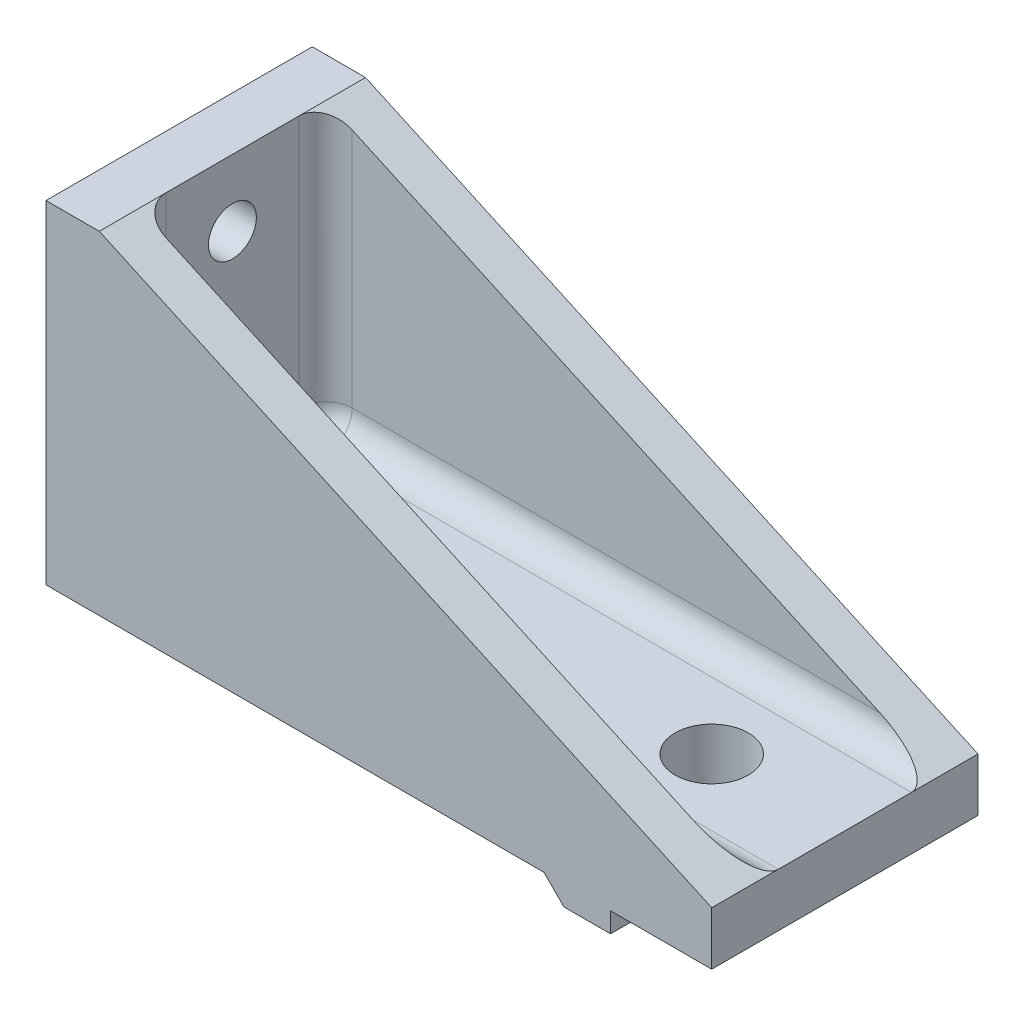
ISO-10303-21;
HEADER;
FILE_DESCRIPTION(('STEP AP214'),'2;1');
FILE_NAME('part.step','',(''),(''),'','','');
FILE_SCHEMA(('AUTOMOTIVE_DESIGN { 1 0 10303 214 1 1 1 1 }'));
ENDSEC;
DATA;
#1=APPLICATION_CONTEXT('core data for automotive mechanical design processes');
#2=APPLICATION_PROTOCOL_DEFINITION('international standard','automotive_design',2000,#1);
#3=PRODUCT_CONTEXT('',#1,'mechanical');
#4=PRODUCT('Part','Part','',(#3));
#5=PRODUCT_RELATED_PRODUCT_CATEGORY('part','',(#4));
#6=PRODUCT_DEFINITION_FORMATION('','',#4);
#7=PRODUCT_DEFINITION_CONTEXT('part definition',#1,'design');
#8=PRODUCT_DEFINITION('design','',#6,#7);
#9=PRODUCT_DEFINITION_SHAPE('','',#8);
#10=(LENGTH_UNIT() NAMED_UNIT(*) SI_UNIT(.MILLI.,.METRE.));
#11=(NAMED_UNIT(*) PLANE_ANGLE_UNIT() SI_UNIT($,.RADIAN.));
#12=(NAMED_UNIT(*) SI_UNIT($,.STERADIAN.) SOLID_ANGLE_UNIT());
#13=UNCERTAINTY_MEASURE_WITH_UNIT(LENGTH_MEASURE(1.E-05),#10,'distance_accuracy_value','');
#14=(GEOMETRIC_REPRESENTATION_CONTEXT(3) GLOBAL_UNCERTAINTY_ASSIGNED_CONTEXT((#13)) GLOBAL_UNIT_ASSIGNED_CONTEXT((#10,
#11,#12)) REPRESENTATION_CONTEXT('',''));
#15=CARTESIAN_POINT('',(0.,0.,0.));
#16=DIRECTION('',(0.,0.,1.));
#17=DIRECTION('',(1.,0.,0.));
#18=AXIS2_PLACEMENT_3D('',#15,#16,#17);
#19=CARTESIAN_POINT('',(37.4,0.,10.));
#20=DIRECTION('',(0.707106781186549,0.707106781186546,0.));
#21=DIRECTION('',(-0.707106781186546,0.707106781186549,0.));
#22=AXIS2_PLACEMENT_3D('',#19,#20,#21);
#23=PLANE('',#22);
#24=DIRECTION('',(0.,0.,-1.));
#25=VECTOR('',#24,1.);
#26=CARTESIAN_POINT('',(37.4,0.,10.));
#27=LINE('',#26,#25);
#28=CARTESIAN_POINT('',(37.4,0.,10.));
#29=VERTEX_POINT('',#28);
#30=CARTESIAN_POINT('',(37.4,0.,3.));
#31=VERTEX_POINT('',#30);
#32=EDGE_CURVE('E215',#29,#31,#27,.T.);
#33=ORIENTED_EDGE('',*,*,#32,.T.);
#34=DIRECTION('',(0.707106781186546,-0.707106781186549,0.));
#35=VECTOR('',#34,1.);
#36=CARTESIAN_POINT('',(37.4,0.,3.));
#37=LINE('',#36,#35);
#38=CARTESIAN_POINT('',(38.9,-1.5,3.));
#39=VERTEX_POINT('',#38);
#40=EDGE_CURVE('E332',#31,#39,#37,.T.);
#41=ORIENTED_EDGE('',*,*,#40,.T.);
#42=DIRECTION('',(0.,0.,-1.));
#43=VECTOR('',#42,1.);
#44=CARTESIAN_POINT('',(38.9,-1.5,10.));
#45=LINE('',#44,#43);
#46=CARTESIAN_POINT('',(38.9,-1.5,10.));
#47=VERTEX_POINT('',#46);
#48=EDGE_CURVE('E211',#47,#39,#45,.T.);
#49=ORIENTED_EDGE('',*,*,#48,.F.);
#50=DIRECTION('',(0.707106781186546,-0.707106781186549,0.));
#51=VECTOR('',#50,1.);
#52=CARTESIAN_POINT('',(37.4,0.,10.));
#53=LINE('',#52,#51);
#54=EDGE_CURVE('E342',#29,#47,#53,.T.);
#55=ORIENTED_EDGE('',*,*,#54,.F.);
#56=EDGE_LOOP('',(#33,#41,#49,#55));
#57=FACE_BOUND('',#56,.T.);
#58=ADVANCED_FACE('F32',(#57),#23,.F.);
#59=CARTESIAN_POINT('',(42.4,-1.5,10.));
#60=DIRECTION('',(0.,1.,0.));
#61=DIRECTION('',(-1.,0.,0.));
#62=AXIS2_PLACEMENT_3D('',#59,#60,#61);
#63=PLANE('',#62);
#64=ORIENTED_EDGE('',*,*,#48,.T.);
#65=DIRECTION('',(1.,0.,0.));
#66=VECTOR('',#65,1.);
#67=CARTESIAN_POINT('',(0.,-1.5,3.));
#68=LINE('',#67,#66);
#69=CARTESIAN_POINT('',(42.4,-1.5,3.));
#70=VERTEX_POINT('',#69);
#71=EDGE_CURVE('E223',#39,#70,#68,.T.);
#72=ORIENTED_EDGE('',*,*,#71,.T.);
#73=DIRECTION('',(0.,0.,-1.));
#74=VECTOR('',#73,1.);
#75=CARTESIAN_POINT('',(42.4,-1.5,10.));
#76=LINE('',#75,#74);
#77=CARTESIAN_POINT('',(42.4,-1.5,10.));
#78=VERTEX_POINT('',#77);
#79=EDGE_CURVE('E207',#78,#70,#76,.T.);
#80=ORIENTED_EDGE('',*,*,#79,.F.);
#81=DIRECTION('',(1.,0.,0.));
#82=VECTOR('',#81,1.);
#83=CARTESIAN_POINT('',(42.4,-1.5,10.));
#84=LINE('',#83,#82);
#85=EDGE_CURVE('E344',#47,#78,#84,.T.);
#86=ORIENTED_EDGE('',*,*,#85,.F.);
#87=EDGE_LOOP('',(#64,#72,#80,#86));
#88=FACE_BOUND('',#87,.T.);
#89=ADVANCED_FACE('F402',(#88),#63,.F.);
#90=CARTESIAN_POINT('',(42.4,0.,10.));
#91=DIRECTION('',(-1.,0.,0.));
#92=DIRECTION('',(0.,0.,1.));
#93=AXIS2_PLACEMENT_3D('',#90,#91,#92);
#94=PLANE('',#93);
#95=ORIENTED_EDGE('',*,*,#79,.T.);
#96=DIRECTION('',(0.,1.,0.));
#97=VECTOR('',#96,1.);
#98=CARTESIAN_POINT('',(42.4,0.,3.));
#99=LINE('',#98,#97);
#100=CARTESIAN_POINT('',(42.4,0.,3.));
#101=VERTEX_POINT('',#100);
#102=EDGE_CURVE('E329',#70,#101,#99,.T.);
#103=ORIENTED_EDGE('',*,*,#102,.T.);
#104=DIRECTION('',(0.,0.,-1.));
#105=VECTOR('',#104,1.);
#106=CARTESIAN_POINT('',(42.4,0.,10.));
#107=LINE('',#106,#105);
#108=CARTESIAN_POINT('',(42.4,0.,10.));
#109=VERTEX_POINT('',#108);
#110=EDGE_CURVE('E204',#109,#101,#107,.T.);
#111=ORIENTED_EDGE('',*,*,#110,.F.);
#112=DIRECTION('',(0.,1.,0.));
#113=VECTOR('',#112,1.);
#114=CARTESIAN_POINT('',(42.4,0.,10.));
#115=LINE('',#114,#113);
#116=EDGE_CURVE('E346',#78,#109,#115,.T.);
#117=ORIENTED_EDGE('',*,*,#116,.F.);
#118=EDGE_LOOP('',(#95,#103,#111,#117));
#119=FACE_BOUND('',#118,.T.);
#120=ADVANCED_FACE('F409',(#119),#94,.F.);
#121=CARTESIAN_POINT('',(0.,25.,10.));
#122=DIRECTION('',(1.,0.,0.));
#123=DIRECTION('',(0.,1.,0.));
#124=AXIS2_PLACEMENT_3D('',#121,#122,#123);
#125=PLANE('',#124);
#126=CARTESIAN_POINT('',(0.,10.,0.));
#127=DIRECTION('',(1.,0.,0.));
#128=DIRECTION('',(0.,1.,0.));
#129=AXIS2_PLACEMENT_3D('',#126,#127,#128);
#130=CIRCLE('',#129,1.8);
#131=CARTESIAN_POINT('',(0.,11.8,0.));
#132=VERTEX_POINT('',#131);
#133=EDGE_CURVE('E302',#132,#132,#130,.T.);
#134=ORIENTED_EDGE('',*,*,#133,.T.);
#135=EDGE_LOOP('',(#134));
#136=FACE_BOUND('',#135,.T.);
#137=CARTESIAN_POINT('',(0.,20.,0.));
#138=DIRECTION('',(1.,0.,0.));
#139=DIRECTION('',(0.,1.,0.));
#140=AXIS2_PLACEMENT_3D('',#137,#138,#139);
#141=CIRCLE('',#140,1.8);
#142=CARTESIAN_POINT('',(0.,21.8,0.));
#143=VERTEX_POINT('',#142);
#144=EDGE_CURVE('E308',#143,#143,#141,.T.);
#145=ORIENTED_EDGE('',*,*,#144,.T.);
#146=EDGE_LOOP('',(#145));
#147=FACE_BOUND('',#146,.T.);
#148=DIRECTION('',(0.,-1.,0.));
#149=VECTOR('',#148,1.);
#150=CARTESIAN_POINT('',(0.,25.,-10.));
#151=LINE('',#150,#149);
#152=CARTESIAN_POINT('',(0.,25.,-10.));
#153=VERTEX_POINT('',#152);
#154=CARTESIAN_POINT('',(0.,0.,-10.));
#155=VERTEX_POINT('',#154);
#156=EDGE_CURVE('E335',#153,#155,#151,.T.);
#157=ORIENTED_EDGE('',*,*,#156,.T.);
#158=DIRECTION('',(0.,0.,-1.));
#159=VECTOR('',#158,1.);
#160=CARTESIAN_POINT('',(0.,0.,10.));
#161=LINE('',#160,#159);
#162=CARTESIAN_POINT('',(0.,0.,10.));
#163=VERTEX_POINT('',#162);
#164=EDGE_CURVE('E217',#163,#155,#161,.T.);
#165=ORIENTED_EDGE('',*,*,#164,.F.);
#166=DIRECTION('',(0.,-1.,0.));
#167=VECTOR('',#166,1.);
#168=CARTESIAN_POINT('',(0.,25.,10.));
#169=LINE('',#168,#167);
#170=CARTESIAN_POINT('',(0.,25.,10.));
#171=VERTEX_POINT('',#170);
#172=EDGE_CURVE('E336',#171,#163,#169,.T.);
#173=ORIENTED_EDGE('',*,*,#172,.F.);
#174=DIRECTION('',(0.,0.,-1.));
#175=VECTOR('',#174,1.);
#176=CARTESIAN_POINT('',(0.,25.,10.));
#177=LINE('',#176,#175);
#178=EDGE_CURVE('E350',#171,#153,#177,.T.);
#179=ORIENTED_EDGE('',*,*,#178,.T.);
#180=EDGE_LOOP('',(#157,#165,#173,#179));
#181=FACE_BOUND('',#180,.T.);
#182=ADVANCED_FACE('F415',(#136,#147,#181),#125,.F.);
#183=CARTESIAN_POINT('',(38.9,-1.5,-3.));
#184=VERTEX_POINT('',#183);
#185=CARTESIAN_POINT('',(38.9,-1.5,-10.));
#186=VERTEX_POINT('',#185);
#187=EDGE_CURVE('E210',#184,#186,#45,.T.);
#188=ORIENTED_EDGE('',*,*,#187,.F.);
#189=DIRECTION('',(-0.707106781186546,0.707106781186549,0.));
#190=VECTOR('',#189,1.);
#191=CARTESIAN_POINT('',(37.4,0.,-3.));
#192=LINE('',#191,#190);
#193=CARTESIAN_POINT('',(37.4,0.,-3.));
#194=VERTEX_POINT('',#193);
#195=EDGE_CURVE('E326',#184,#194,#192,.T.);
#196=ORIENTED_EDGE('',*,*,#195,.T.);
#197=CARTESIAN_POINT('',(37.4,0.,-10.));
#198=VERTEX_POINT('',#197);
#199=EDGE_CURVE('E214',#194,#198,#27,.T.);
#200=ORIENTED_EDGE('',*,*,#199,.T.);
#201=DIRECTION('',(0.707106781186546,-0.707106781186549,0.));
#202=VECTOR('',#201,1.);
#203=CARTESIAN_POINT('',(37.4,0.,-10.));
#204=LINE('',#203,#202);
#205=EDGE_CURVE('E356',#198,#186,#204,.T.);
#206=ORIENTED_EDGE('',*,*,#205,.T.);
#207=EDGE_LOOP('',(#188,#196,#200,#206));
#208=FACE_BOUND('',#207,.T.);
#209=ADVANCED_FACE('F405',(#208),#23,.F.);
#210=CARTESIAN_POINT('',(42.4,-1.5,-3.));
#211=VERTEX_POINT('',#210);
#212=CARTESIAN_POINT('',(42.4,-1.5,-10.));
#213=VERTEX_POINT('',#212);
#214=EDGE_CURVE('E206',#211,#213,#76,.T.);
#215=ORIENTED_EDGE('',*,*,#214,.F.);
#216=DIRECTION('',(1.,0.,0.));
#217=VECTOR('',#216,1.);
#218=CARTESIAN_POINT('',(0.,-1.5,-3.));
#219=LINE('',#218,#217);
#220=EDGE_CURVE('E320',#184,#211,#219,.T.);
#221=ORIENTED_EDGE('',*,*,#220,.F.);
#222=ORIENTED_EDGE('',*,*,#187,.T.);
#223=DIRECTION('',(1.,0.,0.));
#224=VECTOR('',#223,1.);
#225=CARTESIAN_POINT('',(42.4,-1.5,-10.));
#226=LINE('',#225,#224);
#227=EDGE_CURVE('E359',#186,#213,#226,.T.);
#228=ORIENTED_EDGE('',*,*,#227,.T.);
#229=EDGE_LOOP('',(#215,#221,#222,#228));
#230=FACE_BOUND('',#229,.T.);
#231=ADVANCED_FACE('F412',(#230),#63,.F.);
#232=CARTESIAN_POINT('',(42.4,0.,-3.));
#233=VERTEX_POINT('',#232);
#234=CARTESIAN_POINT('',(42.4,0.,-10.));
#235=VERTEX_POINT('',#234);
#236=EDGE_CURVE('E199',#233,#235,#107,.T.);
#237=ORIENTED_EDGE('',*,*,#236,.F.);
#238=DIRECTION('',(0.,-1.,0.));
#239=VECTOR('',#238,1.);
#240=CARTESIAN_POINT('',(42.4,0.,-3.));
#241=LINE('',#240,#239);
#242=EDGE_CURVE('E316',#233,#211,#241,.T.);
#243=ORIENTED_EDGE('',*,*,#242,.T.);
#244=ORIENTED_EDGE('',*,*,#214,.T.);
#245=DIRECTION('',(0.,1.,0.));
#246=VECTOR('',#245,1.);
#247=CARTESIAN_POINT('',(42.4,0.,-10.));
#248=LINE('',#247,#246);
#249=EDGE_CURVE('E362',#213,#235,#248,.T.);
#250=ORIENTED_EDGE('',*,*,#249,.T.);
#251=EDGE_LOOP('',(#237,#243,#244,#250));
#252=FACE_BOUND('',#251,.T.);
#253=ADVANCED_FACE('F421',(#252),#94,.F.);
#254=CARTESIAN_POINT('',(42.4,0.,10.));
#255=DIRECTION('',(0.,1.,0.));
#256=DIRECTION('',(0.,0.,1.));
#257=AXIS2_PLACEMENT_3D('',#254,#255,#256);
#258=PLANE('',#257);
#259=CARTESIAN_POINT('',(40.,0.,0.));
#260=DIRECTION('',(0.,-1.,0.));
#261=DIRECTION('',(0.,0.,-1.));
#262=AXIS2_PLACEMENT_3D('',#259,#260,#261);
#263=CIRCLE('',#262,2.74999999999999);
#264=CARTESIAN_POINT('',(40.,0.,-2.74999999999999));
#265=VERTEX_POINT('',#264);
#266=EDGE_CURVE('E224',#265,#265,#263,.T.);
#267=ORIENTED_EDGE('',*,*,#266,.F.);
#268=EDGE_LOOP('',(#267));
#269=FACE_BOUND('',#268,.T.);
#270=DIRECTION('',(1.,0.,0.));
#271=VECTOR('',#270,1.);
#272=CARTESIAN_POINT('',(42.4,0.,-10.));
#273=LINE('',#272,#271);
#274=CARTESIAN_POINT('',(50.,0.,-10.));
#275=VERTEX_POINT('',#274);
#276=EDGE_CURVE('E365',#235,#275,#273,.T.);
#277=ORIENTED_EDGE('',*,*,#276,.T.);
#278=DIRECTION('',(0.,0.,-1.));
#279=VECTOR('',#278,1.);
#280=CARTESIAN_POINT('',(50.,0.,10.));
#281=LINE('',#280,#279);
#282=CARTESIAN_POINT('',(50.,0.,10.));
#283=VERTEX_POINT('',#282);
#284=EDGE_CURVE('E197',#283,#275,#281,.T.);
#285=ORIENTED_EDGE('',*,*,#284,.F.);
#286=DIRECTION('',(1.,0.,0.));
#287=VECTOR('',#286,1.);
#288=CARTESIAN_POINT('',(42.4,0.,10.));
#289=LINE('',#288,#287);
#290=EDGE_CURVE('E190',#109,#283,#289,.T.);
#291=ORIENTED_EDGE('',*,*,#290,.F.);
#292=ORIENTED_EDGE('',*,*,#110,.T.);
#293=DIRECTION('',(1.,0.,0.));
#294=VECTOR('',#293,1.);
#295=CARTESIAN_POINT('',(0.,0.,3.));
#296=LINE('',#295,#294);
#297=EDGE_CURVE('E313',#31,#101,#296,.T.);
#298=ORIENTED_EDGE('',*,*,#297,.F.);
#299=ORIENTED_EDGE('',*,*,#32,.F.);
#300=DIRECTION('',(1.,0.,0.));
#301=VECTOR('',#300,1.);
#302=CARTESIAN_POINT('',(0.,0.,10.));
#303=LINE('',#302,#301);
#304=EDGE_CURVE('E339',#163,#29,#303,.T.);
#305=ORIENTED_EDGE('',*,*,#304,.F.);
#306=ORIENTED_EDGE('',*,*,#164,.T.);
#307=DIRECTION('',(1.,0.,0.));
#308=VECTOR('',#307,1.);
#309=CARTESIAN_POINT('',(0.,0.,-10.));
#310=LINE('',#309,#308);
#311=EDGE_CURVE('E353',#155,#198,#310,.T.);
#312=ORIENTED_EDGE('',*,*,#311,.T.);
#313=ORIENTED_EDGE('',*,*,#199,.F.);
#314=DIRECTION('',(1.,0.,0.));
#315=VECTOR('',#314,1.);
#316=CARTESIAN_POINT('',(0.,0.,-3.));
#317=LINE('',#316,#315);
#318=EDGE_CURVE('E317',#194,#233,#317,.T.);
#319=ORIENTED_EDGE('',*,*,#318,.T.);
#320=ORIENTED_EDGE('',*,*,#236,.T.);
#321=EDGE_LOOP('',(#277,#285,#291,#292,#298,#299,#305,#306,#312,#313,#319,#320));
#322=FACE_BOUND('',#321,.T.);
#323=ADVANCED_FACE('F437',(#269,#322),#258,.F.);
#324=CARTESIAN_POINT('',(50.,0.,10.));
#325=DIRECTION('',(-1.,0.,0.));
#326=DIRECTION('',(0.,0.,1.));
#327=AXIS2_PLACEMENT_3D('',#324,#325,#326);
#328=PLANE('',#327);
#329=DIRECTION('',(0.,0.,-1.));
#330=VECTOR('',#329,1.);
#331=CARTESIAN_POINT('',(50.,4.,10.));
#332=LINE('',#331,#330);
#333=CARTESIAN_POINT('',(50.,4.,5.));
#334=VERTEX_POINT('',#333);
#335=CARTESIAN_POINT('',(50.,4.,-5.));
#336=VERTEX_POINT('',#335);
#337=EDGE_CURVE('E195',#334,#336,#332,.T.);
#338=ORIENTED_EDGE('',*,*,#337,.F.);
#339=CARTESIAN_POINT('',(50.,4.,10.));
#340=VERTEX_POINT('',#339);
#341=EDGE_CURVE('E72',#340,#334,#332,.T.);
#342=ORIENTED_EDGE('',*,*,#341,.F.);
#343=DIRECTION('',(0.,1.,0.));
#344=VECTOR('',#343,1.);
#345=CARTESIAN_POINT('',(50.,0.,10.));
#346=LINE('',#345,#344);
#347=EDGE_CURVE('E187',#283,#340,#346,.T.);
#348=ORIENTED_EDGE('',*,*,#347,.F.);
#349=ORIENTED_EDGE('',*,*,#284,.T.);
#350=DIRECTION('',(0.,1.,0.));
#351=VECTOR('',#350,1.);
#352=CARTESIAN_POINT('',(50.,0.,-10.));
#353=LINE('',#352,#351);
#354=CARTESIAN_POINT('',(50.,4.,-10.));
#355=VERTEX_POINT('',#354);
#356=EDGE_CURVE('E368',#275,#355,#353,.T.);
#357=ORIENTED_EDGE('',*,*,#356,.T.);
#358=DIRECTION('',(0.,0.,-1.));
#359=VECTOR('',#358,1.);
#360=CARTESIAN_POINT('',(50.,4.,-7.));
#361=LINE('',#360,#359);
#362=EDGE_CURVE('E49',#336,#355,#361,.T.);
#363=ORIENTED_EDGE('',*,*,#362,.F.);
#364=EDGE_LOOP('',(#338,#342,#348,#349,#357,#363));
#365=FACE_BOUND('',#364,.T.);
#366=ADVANCED_FACE('F194',(#365),#328,.F.);
#367=CARTESIAN_POINT('',(50.,4.,10.));
#368=DIRECTION('',(0.,-1.,0.));
#369=DIRECTION('',(1.,0.,0.));
#370=AXIS2_PLACEMENT_3D('',#367,#368,#369);
#371=PLANE('',#370);
#372=CARTESIAN_POINT('',(40.,4.,0.));
#373=DIRECTION('',(0.,-1.,0.));
#374=DIRECTION('',(1.,0.,0.));
#375=AXIS2_PLACEMENT_3D('',#372,#373,#374);
#376=CIRCLE('',#375,2.74999999999999);
#377=CARTESIAN_POINT('',(42.75,4.,0.));
#378=VERTEX_POINT('',#377);
#379=EDGE_CURVE('E220',#378,#378,#376,.T.);
#380=ORIENTED_EDGE('',*,*,#379,.T.);
#381=EDGE_LOOP('',(#380));
#382=FACE_BOUND('',#381,.T.);
#383=DIRECTION('',(0.,0.,-1.));
#384=VECTOR('',#383,1.);
#385=CARTESIAN_POINT('',(6.,3.99999999999999,7.));
#386=LINE('',#385,#384);
#387=CARTESIAN_POINT('',(6.,3.99999999999999,-5.));
#388=VERTEX_POINT('',#387);
#389=CARTESIAN_POINT('',(6.,3.99999999999999,5.));
#390=VERTEX_POINT('',#389);
#391=EDGE_CURVE('E238',#388,#390,#386,.F.);
#392=ORIENTED_EDGE('',*,*,#391,.T.);
#393=DIRECTION('',(1.,0.,0.));
#394=VECTOR('',#393,1.);
#395=CARTESIAN_POINT('',(50.,4.,5.));
#396=LINE('',#395,#394);
#397=EDGE_CURVE('E242',#390,#334,#396,.T.);
#398=ORIENTED_EDGE('',*,*,#397,.T.);
#399=ORIENTED_EDGE('',*,*,#337,.T.);
#400=DIRECTION('',(-1.,0.,0.));
#401=VECTOR('',#400,1.);
#402=CARTESIAN_POINT('',(50.,4.,-5.));
#403=LINE('',#402,#401);
#404=EDGE_CURVE('E240',#336,#388,#403,.T.);
#405=ORIENTED_EDGE('',*,*,#404,.T.);
#406=EDGE_LOOP('',(#392,#398,#399,#405));
#407=FACE_BOUND('',#406,.T.);
#408=ADVANCED_FACE('F469',(#382,#407),#371,.F.);
#409=CARTESIAN_POINT('',(4.,3.99999999999999,10.));
#410=DIRECTION('',(-1.,0.,0.));
#411=DIRECTION('',(0.,-1.,0.));
#412=AXIS2_PLACEMENT_3D('',#409,#410,#411);
#413=PLANE('',#412);
#414=CARTESIAN_POINT('',(4.,10.,0.));
#415=DIRECTION('',(1.,0.,0.));
#416=DIRECTION('',(0.,0.,-1.));
#417=AXIS2_PLACEMENT_3D('',#414,#415,#416);
#418=CIRCLE('',#417,1.8);
#419=CARTESIAN_POINT('',(4.,10.,-1.8));
#420=VERTEX_POINT('',#419);
#421=EDGE_CURVE('E297',#420,#420,#418,.T.);
#422=ORIENTED_EDGE('',*,*,#421,.F.);
#423=EDGE_LOOP('',(#422));
#424=FACE_BOUND('',#423,.T.);
#425=CARTESIAN_POINT('',(4.,20.,0.));
#426=DIRECTION('',(1.,0.,0.));
#427=DIRECTION('',(0.,0.,-1.));
#428=AXIS2_PLACEMENT_3D('',#425,#426,#427);
#429=CIRCLE('',#428,1.8);
#430=CARTESIAN_POINT('',(4.,20.,-1.8));
#431=VERTEX_POINT('',#430);
#432=EDGE_CURVE('E305',#431,#431,#429,.T.);
#433=ORIENTED_EDGE('',*,*,#432,.F.);
#434=EDGE_LOOP('',(#433));
#435=FACE_BOUND('',#434,.T.);
#436=DIRECTION('',(0.,0.,-1.));
#437=VECTOR('',#436,1.);
#438=CARTESIAN_POINT('',(4.,5.99999999999999,-7.));
#439=LINE('',#438,#437);
#440=CARTESIAN_POINT('',(4.,5.99999999999999,5.));
#441=VERTEX_POINT('',#440);
#442=CARTESIAN_POINT('',(4.,5.99999999999999,-5.));
#443=VERTEX_POINT('',#442);
#444=EDGE_CURVE('E219',#441,#443,#439,.T.);
#445=ORIENTED_EDGE('',*,*,#444,.T.);
#446=DIRECTION('',(0.,1.,0.));
#447=VECTOR('',#446,1.);
#448=CARTESIAN_POINT('',(4.,3.99999999999999,-5.));
#449=LINE('',#448,#447);
#450=CARTESIAN_POINT('',(4.,25.,-5.));
#451=VERTEX_POINT('',#450);
#452=EDGE_CURVE('E228',#443,#451,#449,.T.);
#453=ORIENTED_EDGE('',*,*,#452,.T.);
#454=DIRECTION('',(0.,0.,-1.));
#455=VECTOR('',#454,1.);
#456=CARTESIAN_POINT('',(4.,25.,10.));
#457=LINE('',#456,#455);
#458=CARTESIAN_POINT('',(4.,25.,5.));
#459=VERTEX_POINT('',#458);
#460=EDGE_CURVE('E281',#459,#451,#457,.T.);
#461=ORIENTED_EDGE('',*,*,#460,.F.);
#462=DIRECTION('',(0.,-1.,0.));
#463=VECTOR('',#462,1.);
#464=CARTESIAN_POINT('',(4.,3.99999999999999,5.));
#465=LINE('',#464,#463);
#466=EDGE_CURVE('E226',#459,#441,#465,.T.);
#467=ORIENTED_EDGE('',*,*,#466,.T.);
#468=EDGE_LOOP('',(#445,#453,#461,#467));
#469=FACE_BOUND('',#468,.T.);
#470=ADVANCED_FACE('F278',(#424,#435,#469),#413,.F.);
#471=CARTESIAN_POINT('',(4.,25.,10.));
#472=DIRECTION('',(0.,-1.,0.));
#473=DIRECTION('',(0.,0.,-1.));
#474=AXIS2_PLACEMENT_3D('',#471,#472,#473);
#475=PLANE('',#474);
#476=DIRECTION('',(-1.,0.,0.));
#477=VECTOR('',#476,1.);
#478=CARTESIAN_POINT('',(4.,25.,-10.));
#479=LINE('',#478,#477);
#480=CARTESIAN_POINT('',(4.,25.,-10.));
#481=VERTEX_POINT('',#480);
#482=EDGE_CURVE('E340',#481,#153,#479,.T.);
#483=ORIENTED_EDGE('',*,*,#482,.T.);
#484=ORIENTED_EDGE('',*,*,#178,.F.);
#485=DIRECTION('',(-1.,0.,0.));
#486=VECTOR('',#485,1.);
#487=CARTESIAN_POINT('',(4.,25.,10.));
#488=LINE('',#487,#486);
#489=CARTESIAN_POINT('',(4.,25.,10.));
#490=VERTEX_POINT('',#489);
#491=EDGE_CURVE('E192',#490,#171,#488,.T.);
#492=ORIENTED_EDGE('',*,*,#491,.F.);
#493=EDGE_CURVE('E58',#490,#459,#457,.T.);
#494=ORIENTED_EDGE('',*,*,#493,.T.);
#495=ORIENTED_EDGE('',*,*,#460,.T.);
#496=DIRECTION('',(0.,0.,-1.));
#497=VECTOR('',#496,1.);
#498=CARTESIAN_POINT('',(4.,25.,-7.));
#499=LINE('',#498,#497);
#500=EDGE_CURVE('E294',#451,#481,#499,.T.);
#501=ORIENTED_EDGE('',*,*,#500,.T.);
#502=EDGE_LOOP('',(#483,#484,#492,#494,#495,#501));
#503=FACE_BOUND('',#502,.T.);
#504=ADVANCED_FACE('F374',(#503),#475,.F.);
#505=CARTESIAN_POINT('',(0.,0.,10.));
#506=DIRECTION('',(0.,0.,1.));
#507=DIRECTION('',(1.,0.,0.));
#508=AXIS2_PLACEMENT_3D('',#505,#506,#507);
#509=PLANE('',#508);
#510=ORIENTED_EDGE('',*,*,#304,.T.);
#511=ORIENTED_EDGE('',*,*,#54,.T.);
#512=ORIENTED_EDGE('',*,*,#85,.T.);
#513=ORIENTED_EDGE('',*,*,#116,.T.);
#514=ORIENTED_EDGE('',*,*,#290,.T.);
#515=ORIENTED_EDGE('',*,*,#347,.T.);
#516=DIRECTION('',(0.909688003863034,-0.415292349589646,0.));
#517=VECTOR('',#516,1.);
#518=CARTESIAN_POINT('',(4.,25.,10.));
#519=LINE('',#518,#517);
#520=EDGE_CURVE('E179',#490,#340,#519,.T.);
#521=ORIENTED_EDGE('',*,*,#520,.F.);
#522=ORIENTED_EDGE('',*,*,#491,.T.);
#523=ORIENTED_EDGE('',*,*,#172,.T.);
#524=EDGE_LOOP('',(#510,#511,#512,#513,#514,#515,#521,#522,#523));
#525=FACE_BOUND('',#524,.T.);
#526=ADVANCED_FACE('F188',(#525),#509,.T.);
#527=CARTESIAN_POINT('',(0.,0.,-10.));
#528=DIRECTION('',(0.,0.,1.));
#529=DIRECTION('',(1.,0.,0.));
#530=AXIS2_PLACEMENT_3D('',#527,#528,#529);
#531=PLANE('',#530);
#532=ORIENTED_EDGE('',*,*,#205,.F.);
#533=ORIENTED_EDGE('',*,*,#311,.F.);
#534=ORIENTED_EDGE('',*,*,#156,.F.);
#535=ORIENTED_EDGE('',*,*,#482,.F.);
#536=DIRECTION('',(0.909688003863034,-0.415292349589646,0.));
#537=VECTOR('',#536,1.);
#538=CARTESIAN_POINT('',(4.,25.,-10.));
#539=LINE('',#538,#537);
#540=EDGE_CURVE('E287',#481,#355,#539,.T.);
#541=ORIENTED_EDGE('',*,*,#540,.T.);
#542=ORIENTED_EDGE('',*,*,#356,.F.);
#543=ORIENTED_EDGE('',*,*,#276,.F.);
#544=ORIENTED_EDGE('',*,*,#249,.F.);
#545=ORIENTED_EDGE('',*,*,#227,.F.);
#546=EDGE_LOOP('',(#532,#533,#534,#535,#541,#542,#543,#544,#545));
#547=FACE_BOUND('',#546,.T.);
#548=ADVANCED_FACE('F443',(#547),#531,.F.);
#549=CARTESIAN_POINT('',(0.,0.,3.));
#550=DIRECTION('',(0.,0.,1.));
#551=DIRECTION('',(1.,0.,0.));
#552=AXIS2_PLACEMENT_3D('',#549,#550,#551);
#553=PLANE('',#552);
#554=ORIENTED_EDGE('',*,*,#297,.T.);
#555=ORIENTED_EDGE('',*,*,#102,.F.);
#556=ORIENTED_EDGE('',*,*,#71,.F.);
#557=ORIENTED_EDGE('',*,*,#40,.F.);
#558=EDGE_LOOP('',(#554,#555,#556,#557));
#559=FACE_BOUND('',#558,.T.);
#560=ADVANCED_FACE('F451',(#559),#553,.F.);
#561=CARTESIAN_POINT('',(0.,0.,-3.));
#562=DIRECTION('',(0.,0.,-1.));
#563=DIRECTION('',(-1.,0.,0.));
#564=AXIS2_PLACEMENT_3D('',#561,#562,#563);
#565=PLANE('',#564);
#566=ORIENTED_EDGE('',*,*,#220,.T.);
#567=ORIENTED_EDGE('',*,*,#242,.F.);
#568=ORIENTED_EDGE('',*,*,#318,.F.);
#569=ORIENTED_EDGE('',*,*,#195,.F.);
#570=EDGE_LOOP('',(#566,#567,#568,#569));
#571=FACE_BOUND('',#570,.T.);
#572=ADVANCED_FACE('F432',(#571),#565,.F.);
#573=CARTESIAN_POINT('',(40.,20.,0.));
#574=DIRECTION('',(0.,-1.,0.));
#575=DIRECTION('',(0.,0.,-1.));
#576=AXIS2_PLACEMENT_3D('',#573,#574,#575);
#577=CYLINDRICAL_SURFACE('',#576,2.74999999999999);
#578=ORIENTED_EDGE('',*,*,#266,.T.);
#579=EDGE_LOOP('',(#578));
#580=FACE_BOUND('',#579,.T.);
#581=ORIENTED_EDGE('',*,*,#379,.F.);
#582=EDGE_LOOP('',(#581));
#583=FACE_BOUND('',#582,.T.);
#584=ADVANCED_FACE('F489',(#580,#583),#577,.F.);
#585=CARTESIAN_POINT('',(-16.,20.,0.));
#586=DIRECTION('',(1.,0.,0.));
#587=DIRECTION('',(0.,0.,-1.));
#588=AXIS2_PLACEMENT_3D('',#585,#586,#587);
#589=CYLINDRICAL_SURFACE('',#588,1.8);
#590=ORIENTED_EDGE('',*,*,#432,.T.);
#591=EDGE_LOOP('',(#590));
#592=FACE_BOUND('',#591,.T.);
#593=ORIENTED_EDGE('',*,*,#144,.F.);
#594=EDGE_LOOP('',(#593));
#595=FACE_BOUND('',#594,.T.);
#596=ADVANCED_FACE('F492',(#592,#595),#589,.F.);
#597=CARTESIAN_POINT('',(-16.,10.,0.));
#598=DIRECTION('',(1.,0.,0.));
#599=DIRECTION('',(0.,0.,-1.));
#600=AXIS2_PLACEMENT_3D('',#597,#598,#599);
#601=CYLINDRICAL_SURFACE('',#600,1.8);
#602=ORIENTED_EDGE('',*,*,#421,.T.);
#603=EDGE_LOOP('',(#602));
#604=FACE_BOUND('',#603,.T.);
#605=ORIENTED_EDGE('',*,*,#133,.F.);
#606=EDGE_LOOP('',(#605));
#607=FACE_BOUND('',#606,.T.);
#608=ADVANCED_FACE('F496',(#604,#607),#601,.F.);
#609=CARTESIAN_POINT('',(0.,0.,-7.));
#610=DIRECTION('',(0.,0.,1.));
#611=DIRECTION('',(1.,0.,0.));
#612=AXIS2_PLACEMENT_3D('',#609,#610,#611);
#613=PLANE('',#612);
#614=DIRECTION('',(0.909688003863034,-0.415292349589646,0.));
#615=VECTOR('',#614,1.);
#616=CARTESIAN_POINT('',(4.,25.,-7.));
#617=LINE('',#616,#615);
#618=CARTESIAN_POINT('',(6.,24.0869565217391,-7.));
#619=VERTEX_POINT('',#618);
#620=CARTESIAN_POINT('',(45.6190476190476,6.,-7.));
#621=VERTEX_POINT('',#620);
#622=EDGE_CURVE('E290',#619,#621,#617,.T.);
#623=ORIENTED_EDGE('',*,*,#622,.F.);
#624=DIRECTION('',(0.,1.,0.));
#625=VECTOR('',#624,1.);
#626=CARTESIAN_POINT('',(6.,0.,-7.));
#627=LINE('',#626,#625);
#628=CARTESIAN_POINT('',(6.,5.99999999999999,-7.));
#629=VERTEX_POINT('',#628);
#630=EDGE_CURVE('E233',#619,#629,#627,.F.);
#631=ORIENTED_EDGE('',*,*,#630,.T.);
#632=DIRECTION('',(-1.,0.,0.));
#633=VECTOR('',#632,1.);
#634=CARTESIAN_POINT('',(0.,5.99999999999999,-7.));
#635=LINE('',#634,#633);
#636=EDGE_CURVE('E231',#629,#621,#635,.F.);
#637=ORIENTED_EDGE('',*,*,#636,.T.);
#638=EDGE_LOOP('',(#623,#631,#637));
#639=FACE_BOUND('',#638,.T.);
#640=ADVANCED_FACE('F386',(#639),#613,.T.);
#641=CARTESIAN_POINT('',(4.,25.,-7.));
#642=DIRECTION('',(0.415292349589646,0.909688003863034,0.));
#643=DIRECTION('',(-0.909688003863034,0.415292349589646,0.));
#644=AXIS2_PLACEMENT_3D('',#641,#642,#643);
#645=PLANE('',#644);
#646=ORIENTED_EDGE('',*,*,#540,.F.);
#647=ORIENTED_EDGE('',*,*,#500,.F.);
#648=CARTESIAN_POINT('',(6.,24.0869565217391,-5.));
#649=DIRECTION('',(0.415292349589646,0.909688003863034,0.));
#650=DIRECTION('',(-0.909688003863034,0.415292349589646,0.));
#651=AXIS2_PLACEMENT_3D('',#648,#649,#650);
#652=ELLIPSE('',#651,2.19855597909053,2.);
#653=EDGE_CURVE('E244',#451,#619,#652,.F.);
#654=ORIENTED_EDGE('',*,*,#653,.T.);
#655=ORIENTED_EDGE('',*,*,#622,.T.);
#656=CARTESIAN_POINT('',(45.6190476190476,6.,-5.));
#657=DIRECTION('',(0.415292349589646,0.909688003863034,0.));
#658=DIRECTION('',(-0.909688003863034,0.415292349589646,0.));
#659=AXIS2_PLACEMENT_3D('',#656,#657,#658);
#660=ELLIPSE('',#659,4.81588452562687,2.);
#661=EDGE_CURVE('E11',#621,#336,#660,.F.);
#662=ORIENTED_EDGE('',*,*,#661,.T.);
#663=ORIENTED_EDGE('',*,*,#362,.T.);
#664=EDGE_LOOP('',(#646,#647,#654,#655,#662,#663));
#665=FACE_BOUND('',#664,.T.);
#666=ADVANCED_FACE('F379',(#665),#645,.T.);
#667=CARTESIAN_POINT('',(0.,0.,7.));
#668=DIRECTION('',(0.,0.,-1.));
#669=DIRECTION('',(1.,0.,0.));
#670=AXIS2_PLACEMENT_3D('',#667,#668,#669);
#671=PLANE('',#670);
#672=DIRECTION('',(1.,0.,0.));
#673=VECTOR('',#672,1.);
#674=CARTESIAN_POINT('',(0.,5.99999999999999,7.));
#675=LINE('',#674,#673);
#676=CARTESIAN_POINT('',(45.6190476190476,6.,7.));
#677=VERTEX_POINT('',#676);
#678=CARTESIAN_POINT('',(6.,5.99999999999999,7.));
#679=VERTEX_POINT('',#678);
#680=EDGE_CURVE('E83',#677,#679,#675,.F.);
#681=ORIENTED_EDGE('',*,*,#680,.T.);
#682=DIRECTION('',(0.,-1.,0.));
#683=VECTOR('',#682,1.);
#684=CARTESIAN_POINT('',(6.,0.,7.));
#685=LINE('',#684,#683);
#686=CARTESIAN_POINT('',(6.,24.0869565217391,7.));
#687=VERTEX_POINT('',#686);
#688=EDGE_CURVE('E236',#679,#687,#685,.F.);
#689=ORIENTED_EDGE('',*,*,#688,.T.);
#690=DIRECTION('',(0.909688003863034,-0.415292349589646,0.));
#691=VECTOR('',#690,1.);
#692=CARTESIAN_POINT('',(4.,25.,7.));
#693=LINE('',#692,#691);
#694=EDGE_CURVE('E184',#687,#677,#693,.T.);
#695=ORIENTED_EDGE('',*,*,#694,.T.);
#696=EDGE_LOOP('',(#681,#689,#695));
#697=FACE_BOUND('',#696,.T.);
#698=ADVANCED_FACE('F286',(#697),#671,.T.);
#699=CARTESIAN_POINT('',(4.,25.,7.));
#700=DIRECTION('',(-0.415292349589646,-0.909688003863034,0.));
#701=DIRECTION('',(0.909688003863034,-0.415292349589646,0.));
#702=AXIS2_PLACEMENT_3D('',#699,#700,#701);
#703=PLANE('',#702);
#704=ORIENTED_EDGE('',*,*,#520,.T.);
#705=ORIENTED_EDGE('',*,*,#341,.T.);
#706=CARTESIAN_POINT('',(45.6190476190476,6.,5.));
#707=DIRECTION('',(-0.415292349589646,-0.909688003863034,0.));
#708=DIRECTION('',(0.909688003863034,-0.415292349589646,0.));
#709=AXIS2_PLACEMENT_3D('',#706,#707,#708);
#710=ELLIPSE('',#709,4.81588452562687,2.);
#711=EDGE_CURVE('E41',#334,#677,#710,.T.);
#712=ORIENTED_EDGE('',*,*,#711,.T.);
#713=ORIENTED_EDGE('',*,*,#694,.F.);
#714=CARTESIAN_POINT('',(6.,24.0869565217391,5.));
#715=DIRECTION('',(-0.415292349589646,-0.909688003863034,0.));
#716=DIRECTION('',(0.909688003863034,-0.415292349589646,0.));
#717=AXIS2_PLACEMENT_3D('',#714,#715,#716);
#718=ELLIPSE('',#717,2.19855597909053,2.);
#719=EDGE_CURVE('E246',#687,#459,#718,.T.);
#720=ORIENTED_EDGE('',*,*,#719,.T.);
#721=ORIENTED_EDGE('',*,*,#493,.F.);
#722=EDGE_LOOP('',(#704,#705,#712,#713,#720,#721));
#723=FACE_BOUND('',#722,.T.);
#724=ADVANCED_FACE('F181',(#723),#703,.F.);
#725=CARTESIAN_POINT('',(50.,6.,5.));
#726=DIRECTION('',(1.,0.,0.));
#727=DIRECTION('',(0.,1.,0.));
#728=AXIS2_PLACEMENT_3D('',#725,#726,#727);
#729=CYLINDRICAL_SURFACE('',#728,2.);
#730=ORIENTED_EDGE('',*,*,#711,.F.);
#731=ORIENTED_EDGE('',*,*,#397,.F.);
#732=CARTESIAN_POINT('',(6.,5.99999999999999,5.));
#733=DIRECTION('',(1.,0.,0.));
#734=DIRECTION('',(0.,0.,-1.));
#735=AXIS2_PLACEMENT_3D('',#732,#733,#734);
#736=CIRCLE('',#735,2.);
#737=EDGE_CURVE('E36',#679,#390,#736,.T.);
#738=ORIENTED_EDGE('',*,*,#737,.F.);
#739=ORIENTED_EDGE('',*,*,#680,.F.);
#740=EDGE_LOOP('',(#730,#731,#738,#739));
#741=FACE_BOUND('',#740,.T.);
#742=ADVANCED_FACE('F34',(#741),#729,.F.);
#743=CARTESIAN_POINT('',(6.,3.99999999999999,5.));
#744=DIRECTION('',(0.,-1.,0.));
#745=DIRECTION('',(1.,0.,0.));
#746=AXIS2_PLACEMENT_3D('',#743,#744,#745);
#747=CYLINDRICAL_SURFACE('',#746,2.);
#748=ORIENTED_EDGE('',*,*,#719,.F.);
#749=ORIENTED_EDGE('',*,*,#688,.F.);
#750=CARTESIAN_POINT('',(6.,5.99999999999999,5.));
#751=DIRECTION('',(0.,1.,0.));
#752=DIRECTION('',(0.,0.,1.));
#753=AXIS2_PLACEMENT_3D('',#750,#751,#752);
#754=CIRCLE('',#753,2.);
#755=EDGE_CURVE('E260',#441,#679,#754,.T.);
#756=ORIENTED_EDGE('',*,*,#755,.F.);
#757=ORIENTED_EDGE('',*,*,#466,.F.);
#758=EDGE_LOOP('',(#748,#749,#756,#757));
#759=FACE_BOUND('',#758,.T.);
#760=ADVANCED_FACE('F284',(#759),#747,.F.);
#761=CARTESIAN_POINT('',(6.,5.99999999999999,5.));
#762=DIRECTION('',(0.,0.,1.));
#763=DIRECTION('',(1.,0.,0.));
#764=AXIS2_PLACEMENT_3D('',#761,#762,#763);
#765=SPHERICAL_SURFACE('',#764,2.);
#766=ORIENTED_EDGE('',*,*,#755,.T.);
#767=ORIENTED_EDGE('',*,*,#737,.T.);
#768=CARTESIAN_POINT('',(6.,5.99999999999999,5.));
#769=DIRECTION('',(0.,0.,-1.));
#770=DIRECTION('',(-1.,0.,0.));
#771=AXIS2_PLACEMENT_3D('',#768,#769,#770);
#772=CIRCLE('',#771,2.);
#773=EDGE_CURVE('E258',#441,#390,#772,.F.);
#774=ORIENTED_EDGE('',*,*,#773,.F.);
#775=EDGE_LOOP('',(#766,#767,#774));
#776=FACE_BOUND('',#775,.T.);
#777=ADVANCED_FACE('F267',(#776),#765,.F.);
#778=CARTESIAN_POINT('',(50.,6.,-5.));
#779=DIRECTION('',(-1.,0.,0.));
#780=DIRECTION('',(0.,-1.,0.));
#781=AXIS2_PLACEMENT_3D('',#778,#779,#780);
#782=CYLINDRICAL_SURFACE('',#781,2.);
#783=ORIENTED_EDGE('',*,*,#661,.F.);
#784=ORIENTED_EDGE('',*,*,#636,.F.);
#785=CARTESIAN_POINT('',(6.,5.99999999999999,-5.));
#786=DIRECTION('',(1.,0.,0.));
#787=DIRECTION('',(0.,0.,-1.));
#788=AXIS2_PLACEMENT_3D('',#785,#786,#787);
#789=CIRCLE('',#788,2.);
#790=EDGE_CURVE('E255',#388,#629,#789,.T.);
#791=ORIENTED_EDGE('',*,*,#790,.F.);
#792=ORIENTED_EDGE('',*,*,#404,.F.);
#793=EDGE_LOOP('',(#783,#784,#791,#792));
#794=FACE_BOUND('',#793,.T.);
#795=ADVANCED_FACE('F389',(#794),#782,.F.);
#796=CARTESIAN_POINT('',(6.,5.99999999999999,10.));
#797=DIRECTION('',(0.,0.,1.));
#798=DIRECTION('',(1.,0.,0.));
#799=AXIS2_PLACEMENT_3D('',#796,#797,#798);
#800=CYLINDRICAL_SURFACE('',#799,2.);
#801=ORIENTED_EDGE('',*,*,#773,.T.);
#802=ORIENTED_EDGE('',*,*,#391,.F.);
#803=CARTESIAN_POINT('',(6.,5.99999999999999,-5.));
#804=DIRECTION('',(0.,0.,1.));
#805=DIRECTION('',(1.,0.,0.));
#806=AXIS2_PLACEMENT_3D('',#803,#804,#805);
#807=CIRCLE('',#806,2.);
#808=EDGE_CURVE('E252',#443,#388,#807,.T.);
#809=ORIENTED_EDGE('',*,*,#808,.F.);
#810=ORIENTED_EDGE('',*,*,#444,.F.);
#811=EDGE_LOOP('',(#801,#802,#809,#810));
#812=FACE_BOUND('',#811,.T.);
#813=ADVANCED_FACE('F273',(#812),#800,.F.);
#814=CARTESIAN_POINT('',(6.,5.99999999999999,-5.));
#815=DIRECTION('',(0.,0.,1.));
#816=DIRECTION('',(1.,0.,0.));
#817=AXIS2_PLACEMENT_3D('',#814,#815,#816);
#818=SPHERICAL_SURFACE('',#817,2.);
#819=ORIENTED_EDGE('',*,*,#808,.T.);
#820=ORIENTED_EDGE('',*,*,#790,.T.);
#821=CARTESIAN_POINT('',(6.,5.99999999999999,-5.));
#822=DIRECTION('',(0.,1.,0.));
#823=DIRECTION('',(0.,0.,1.));
#824=AXIS2_PLACEMENT_3D('',#821,#822,#823);
#825=CIRCLE('',#824,2.);
#826=EDGE_CURVE('E249',#443,#629,#825,.F.);
#827=ORIENTED_EDGE('',*,*,#826,.F.);
#828=EDGE_LOOP('',(#819,#820,#827));
#829=FACE_BOUND('',#828,.T.);
#830=ADVANCED_FACE('F392',(#829),#818,.F.);
#831=CARTESIAN_POINT('',(6.,3.99999999999999,-5.));
#832=DIRECTION('',(0.,1.,0.));
#833=DIRECTION('',(-1.,0.,0.));
#834=AXIS2_PLACEMENT_3D('',#831,#832,#833);
#835=CYLINDRICAL_SURFACE('',#834,2.);
#836=ORIENTED_EDGE('',*,*,#826,.T.);
#837=ORIENTED_EDGE('',*,*,#630,.F.);
#838=ORIENTED_EDGE('',*,*,#653,.F.);
#839=ORIENTED_EDGE('',*,*,#452,.F.);
#840=EDGE_LOOP('',(#836,#837,#838,#839));
#841=FACE_BOUND('',#840,.T.);
#842=ADVANCED_FACE('F383',(#841),#835,.F.);
#843=CLOSED_SHELL('',(#58,#89,#120,#182,#209,#231,#253,#323,#366,#408,#470,#504,#526,#548,#560,
#572,#584,#596,#608,#640,#666,#698,#724,#742,#760,#777,#795,#813,#830,#842));
#844=MANIFOLD_SOLID_BREP('B2',#843);
#845=ADVANCED_BREP_SHAPE_REPRESENTATION('',(#18,#844),#14);
#846=SHAPE_DEFINITION_REPRESENTATION(#9,#845);
ENDSEC;
END-ISO-10303-21;
